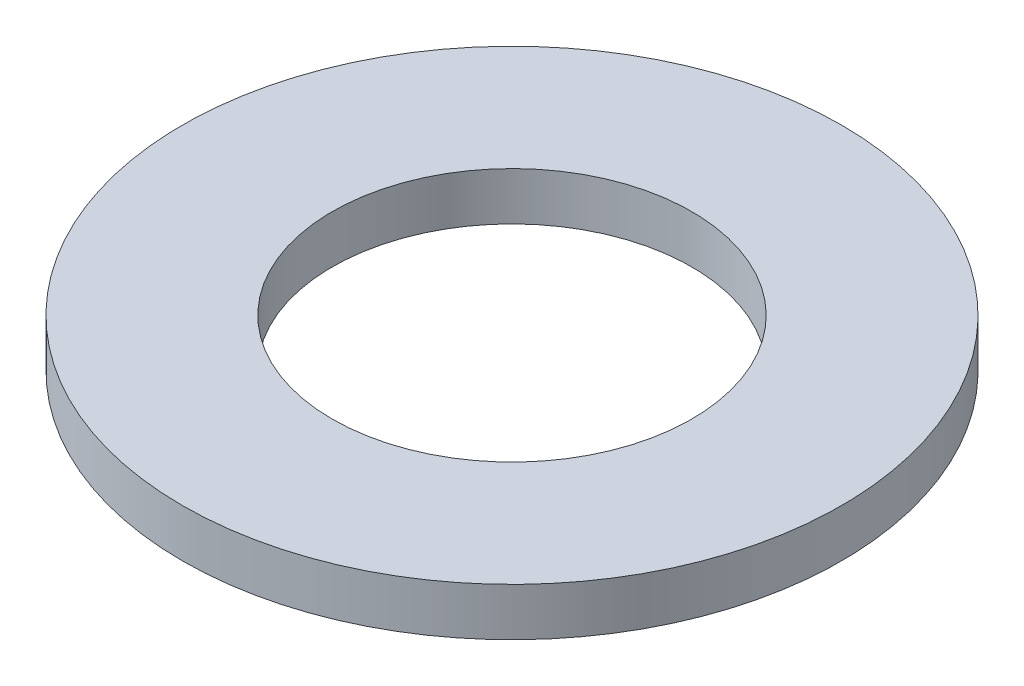
ISO-10303-21;
HEADER;
FILE_DESCRIPTION(('STEP AP214'),'2;1');
FILE_NAME('part.step','',(''),(''),'','','');
FILE_SCHEMA(('AUTOMOTIVE_DESIGN { 1 0 10303 214 1 1 1 1 }'));
ENDSEC;
DATA;
#1=APPLICATION_CONTEXT('core data for automotive mechanical design processes');
#2=APPLICATION_PROTOCOL_DEFINITION('international standard','automotive_design',2000,#1);
#3=PRODUCT_CONTEXT('',#1,'mechanical');
#4=PRODUCT('Part','Part','',(#3));
#5=PRODUCT_RELATED_PRODUCT_CATEGORY('part','',(#4));
#6=PRODUCT_DEFINITION_FORMATION('','',#4);
#7=PRODUCT_DEFINITION_CONTEXT('part definition',#1,'design');
#8=PRODUCT_DEFINITION('design','',#6,#7);
#9=PRODUCT_DEFINITION_SHAPE('','',#8);
#10=(LENGTH_UNIT() NAMED_UNIT(*) SI_UNIT(.MILLI.,.METRE.));
#11=(NAMED_UNIT(*) PLANE_ANGLE_UNIT() SI_UNIT($,.RADIAN.));
#12=(NAMED_UNIT(*) SI_UNIT($,.STERADIAN.) SOLID_ANGLE_UNIT());
#13=UNCERTAINTY_MEASURE_WITH_UNIT(LENGTH_MEASURE(1.E-05),#10,'distance_accuracy_value','');
#14=(GEOMETRIC_REPRESENTATION_CONTEXT(3) GLOBAL_UNCERTAINTY_ASSIGNED_CONTEXT((#13)) GLOBAL_UNIT_ASSIGNED_CONTEXT((#10,
#11,#12)) REPRESENTATION_CONTEXT('',''));
#15=CARTESIAN_POINT('',(0.,0.,0.));
#16=DIRECTION('',(0.,0.,1.));
#17=DIRECTION('',(1.,0.,0.));
#18=AXIS2_PLACEMENT_3D('',#15,#16,#17);
#19=CARTESIAN_POINT('',(0.,8.,0.));
#20=DIRECTION('',(0.,-1.,0.));
#21=DIRECTION('',(0.,0.,-1.));
#22=AXIS2_PLACEMENT_3D('',#19,#20,#21);
#23=CYLINDRICAL_SURFACE('',#22,55.);
#24=CARTESIAN_POINT('',(0.,8.,0.));
#25=DIRECTION('',(0.,1.,0.));
#26=DIRECTION('',(0.,0.,1.));
#27=AXIS2_PLACEMENT_3D('',#24,#25,#26);
#28=CIRCLE('',#27,55.);
#29=CARTESIAN_POINT('',(0.,8.,55.));
#30=VERTEX_POINT('',#29);
#31=EDGE_CURVE('E10',#30,#30,#28,.T.);
#32=ORIENTED_EDGE('',*,*,#31,.F.);
#33=EDGE_LOOP('',(#32));
#34=FACE_BOUND('',#33,.T.);
#35=CARTESIAN_POINT('',(0.,0.,0.));
#36=DIRECTION('',(0.,1.,0.));
#37=DIRECTION('',(0.,0.,1.));
#38=AXIS2_PLACEMENT_3D('',#35,#36,#37);
#39=CIRCLE('',#38,55.);
#40=CARTESIAN_POINT('',(0.,0.,55.));
#41=VERTEX_POINT('',#40);
#42=EDGE_CURVE('E37',#41,#41,#39,.T.);
#43=ORIENTED_EDGE('',*,*,#42,.T.);
#44=EDGE_LOOP('',(#43));
#45=FACE_BOUND('',#44,.T.);
#46=ADVANCED_FACE('F40',(#34,#45),#23,.T.);
#47=CARTESIAN_POINT('',(0.,8.,0.));
#48=DIRECTION('',(0.,1.,0.));
#49=DIRECTION('',(0.,0.,1.));
#50=AXIS2_PLACEMENT_3D('',#47,#48,#49);
#51=PLANE('',#50);
#52=CARTESIAN_POINT('',(0.,8.,0.));
#53=DIRECTION('',(0.,1.,0.));
#54=DIRECTION('',(0.,0.,1.));
#55=AXIS2_PLACEMENT_3D('',#52,#53,#54);
#56=CIRCLE('',#55,30.);
#57=CARTESIAN_POINT('',(0.,8.,30.));
#58=VERTEX_POINT('',#57);
#59=EDGE_CURVE('E50',#58,#58,#56,.T.);
#60=ORIENTED_EDGE('',*,*,#59,.F.);
#61=EDGE_LOOP('',(#60));
#62=FACE_BOUND('',#61,.T.);
#63=ORIENTED_EDGE('',*,*,#31,.T.);
#64=EDGE_LOOP('',(#63));
#65=FACE_BOUND('',#64,.T.);
#66=ADVANCED_FACE('F59',(#62,#65),#51,.T.);
#67=CARTESIAN_POINT('',(0.,0.,0.));
#68=DIRECTION('',(0.,1.,0.));
#69=DIRECTION('',(0.,0.,1.));
#70=AXIS2_PLACEMENT_3D('',#67,#68,#69);
#71=PLANE('',#70);
#72=CARTESIAN_POINT('',(0.,0.,0.));
#73=DIRECTION('',(0.,1.,0.));
#74=DIRECTION('',(0.,0.,1.));
#75=AXIS2_PLACEMENT_3D('',#72,#73,#74);
#76=CIRCLE('',#75,30.);
#77=CARTESIAN_POINT('',(0.,0.,30.));
#78=VERTEX_POINT('',#77);
#79=EDGE_CURVE('E47',#78,#78,#76,.T.);
#80=ORIENTED_EDGE('',*,*,#79,.T.);
#81=EDGE_LOOP('',(#80));
#82=FACE_BOUND('',#81,.T.);
#83=ORIENTED_EDGE('',*,*,#42,.F.);
#84=EDGE_LOOP('',(#83));
#85=FACE_BOUND('',#84,.T.);
#86=ADVANCED_FACE('F58',(#82,#85),#71,.F.);
#87=CARTESIAN_POINT('',(0.,8.,0.));
#88=DIRECTION('',(0.,-1.,0.));
#89=DIRECTION('',(0.,0.,-1.));
#90=AXIS2_PLACEMENT_3D('',#87,#88,#89);
#91=CYLINDRICAL_SURFACE('',#90,30.);
#92=ORIENTED_EDGE('',*,*,#59,.T.);
#93=EDGE_LOOP('',(#92));
#94=FACE_BOUND('',#93,.T.);
#95=ORIENTED_EDGE('',*,*,#79,.F.);
#96=EDGE_LOOP('',(#95));
#97=FACE_BOUND('',#96,.T.);
#98=ADVANCED_FACE('F54',(#94,#97),#91,.F.);
#99=CLOSED_SHELL('',(#46,#66,#86,#98));
#100=MANIFOLD_SOLID_BREP('B2',#99);
#101=ADVANCED_BREP_SHAPE_REPRESENTATION('',(#18,#100),#14);
#102=SHAPE_DEFINITION_REPRESENTATION(#9,#101);
ENDSEC;
END-ISO-10303-21;
